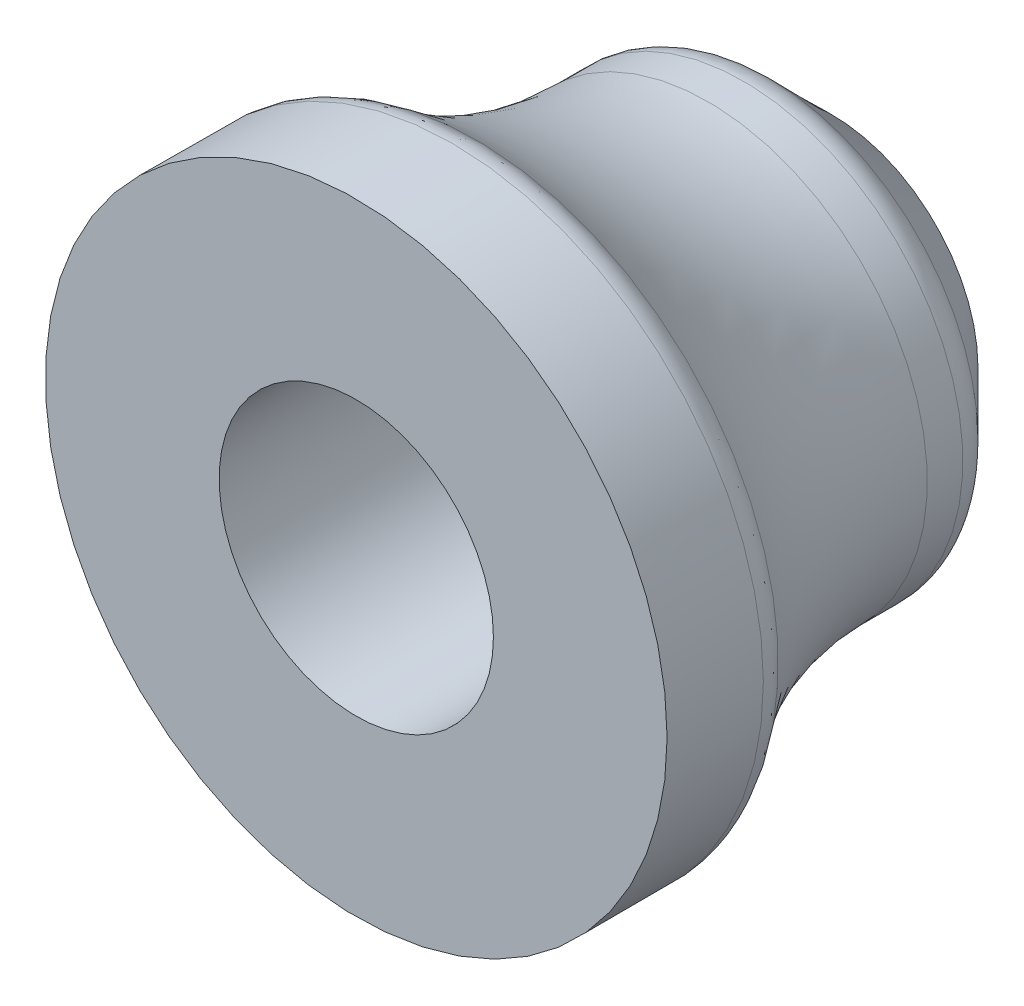
ISO-10303-21;
HEADER;
FILE_DESCRIPTION(('STEP AP214'),'2;1');
FILE_NAME('part.step','',(''),(''),'','','');
FILE_SCHEMA(('AUTOMOTIVE_DESIGN { 1 0 10303 214 1 1 1 1 }'));
ENDSEC;
DATA;
#1=APPLICATION_CONTEXT('core data for automotive mechanical design processes');
#2=APPLICATION_PROTOCOL_DEFINITION('international standard','automotive_design',2000,#1);
#3=PRODUCT_CONTEXT('',#1,'mechanical');
#4=PRODUCT('Part','Part','',(#3));
#5=PRODUCT_RELATED_PRODUCT_CATEGORY('part','',(#4));
#6=PRODUCT_DEFINITION_FORMATION('','',#4);
#7=PRODUCT_DEFINITION_CONTEXT('part definition',#1,'design');
#8=PRODUCT_DEFINITION('design','',#6,#7);
#9=PRODUCT_DEFINITION_SHAPE('','',#8);
#10=(LENGTH_UNIT() NAMED_UNIT(*) SI_UNIT(.MILLI.,.METRE.));
#11=(NAMED_UNIT(*) PLANE_ANGLE_UNIT() SI_UNIT($,.RADIAN.));
#12=(NAMED_UNIT(*) SI_UNIT($,.STERADIAN.) SOLID_ANGLE_UNIT());
#13=UNCERTAINTY_MEASURE_WITH_UNIT(LENGTH_MEASURE(1.E-05),#10,'distance_accuracy_value','');
#14=(GEOMETRIC_REPRESENTATION_CONTEXT(3) GLOBAL_UNCERTAINTY_ASSIGNED_CONTEXT((#13)) GLOBAL_UNIT_ASSIGNED_CONTEXT((#10,
#11,#12)) REPRESENTATION_CONTEXT('',''));
#15=CARTESIAN_POINT('',(0.,0.,0.));
#16=DIRECTION('',(0.,0.,1.));
#17=DIRECTION('',(1.,0.,0.));
#18=AXIS2_PLACEMENT_3D('',#15,#16,#17);
#19=CARTESIAN_POINT('',(0.,0.,0.));
#20=DIRECTION('',(0.,0.,1.));
#21=DIRECTION('',(1.,0.,0.));
#22=AXIS2_PLACEMENT_3D('',#19,#20,#21);
#23=PLANE('',#22);
#24=CARTESIAN_POINT('',(0.,0.,0.));
#25=DIRECTION('',(0.,0.,1.));
#26=DIRECTION('',(1.,0.,0.));
#27=AXIS2_PLACEMENT_3D('',#24,#25,#26);
#28=CIRCLE('',#27,3.99999999999998);
#29=CARTESIAN_POINT('',(2.63100816623241,-3.01293810577287,0.));
#30=VERTEX_POINT('',#29);
#31=CARTESIAN_POINT('',(2.63100816623241,3.01293810577287,0.));
#32=VERTEX_POINT('',#31);
#33=EDGE_CURVE('E252',#30,#32,#28,.F.);
#34=ORIENTED_EDGE('',*,*,#33,.T.);
#35=DIRECTION('',(1.,0.,0.));
#36=VECTOR('',#35,1.);
#37=CARTESIAN_POINT('',(2.63100816623241,3.01293810577287,0.));
#38=LINE('',#37,#36);
#39=CARTESIAN_POINT('',(0.875588873956595,3.01293810577287,0.));
#40=VERTEX_POINT('',#39);
#41=EDGE_CURVE('E54',#40,#32,#38,.T.);
#42=ORIENTED_EDGE('',*,*,#41,.F.);
#43=DIRECTION('',(0.,1.,0.));
#44=VECTOR('',#43,1.);
#45=CARTESIAN_POINT('',(0.875588873956595,3.01293810577287,0.));
#46=LINE('',#45,#44);
#47=CARTESIAN_POINT('',(0.875588873956594,0.877709646137907,0.));
#48=VERTEX_POINT('',#47);
#49=EDGE_CURVE('E155',#48,#40,#46,.T.);
#50=ORIENTED_EDGE('',*,*,#49,.F.);
#51=DIRECTION('',(0.608440006967927,-0.793599872681989,0.));
#52=VECTOR('',#51,1.);
#53=CARTESIAN_POINT('',(0.875588873956594,0.877709646137907,0.));
#54=LINE('',#53,#52);
#55=CARTESIAN_POINT('',(-0.761455767277883,3.01293810577287,0.));
#56=VERTEX_POINT('',#55);
#57=EDGE_CURVE('E158',#56,#48,#54,.T.);
#58=ORIENTED_EDGE('',*,*,#57,.F.);
#59=DIRECTION('',(1.,0.,0.));
#60=VECTOR('',#59,1.);
#61=CARTESIAN_POINT('',(-0.761455767277883,3.01293810577287,0.));
#62=LINE('',#61,#60);
#63=CARTESIAN_POINT('',(-2.5168750595537,3.01293810577287,0.));
#64=VERTEX_POINT('',#63);
#65=EDGE_CURVE('E204',#64,#56,#62,.T.);
#66=ORIENTED_EDGE('',*,*,#65,.F.);
#67=DIRECTION('',(-0.608440006967927,0.793599872681989,0.));
#68=VECTOR('',#67,1.);
#69=CARTESIAN_POINT('',(-2.5168750595537,3.01293810577287,0.));
#70=LINE('',#69,#68);
#71=CARTESIAN_POINT('',(-0.20690482748314,0.,0.));
#72=VERTEX_POINT('',#71);
#73=EDGE_CURVE('E201',#72,#64,#70,.T.);
#74=ORIENTED_EDGE('',*,*,#73,.F.);
#75=DIRECTION('',(0.608440006967927,0.793599872681989,0.));
#76=VECTOR('',#75,1.);
#77=CARTESIAN_POINT('',(-0.20690482748314,0.,0.));
#78=LINE('',#77,#76);
#79=CARTESIAN_POINT('',(-2.5168750595537,-3.01293810577287,0.));
#80=VERTEX_POINT('',#79);
#81=EDGE_CURVE('E198',#80,#72,#78,.T.);
#82=ORIENTED_EDGE('',*,*,#81,.F.);
#83=DIRECTION('',(-1.,0.,0.));
#84=VECTOR('',#83,1.);
#85=CARTESIAN_POINT('',(-2.5168750595537,-3.01293810577287,0.));
#86=LINE('',#85,#84);
#87=CARTESIAN_POINT('',(-0.761455767277883,-3.01293810577287,0.));
#88=VERTEX_POINT('',#87);
#89=EDGE_CURVE('E195',#88,#80,#86,.T.);
#90=ORIENTED_EDGE('',*,*,#89,.F.);
#91=DIRECTION('',(-0.608440006967927,-0.793599872681989,0.));
#92=VECTOR('',#91,1.);
#93=CARTESIAN_POINT('',(-0.761455767277883,-3.01293810577287,0.));
#94=LINE('',#93,#92);
#95=CARTESIAN_POINT('',(0.875588873956594,-0.877709646137907,0.));
#96=VERTEX_POINT('',#95);
#97=EDGE_CURVE('E192',#96,#88,#94,.T.);
#98=ORIENTED_EDGE('',*,*,#97,.F.);
#99=DIRECTION('',(0.,1.,0.));
#100=VECTOR('',#99,1.);
#101=CARTESIAN_POINT('',(0.875588873956594,-0.877709646137907,0.));
#102=LINE('',#101,#100);
#103=CARTESIAN_POINT('',(0.875588873956595,-3.01293810577287,0.));
#104=VERTEX_POINT('',#103);
#105=EDGE_CURVE('E189',#104,#96,#102,.T.);
#106=ORIENTED_EDGE('',*,*,#105,.F.);
#107=DIRECTION('',(-1.,0.,0.));
#108=VECTOR('',#107,1.);
#109=CARTESIAN_POINT('',(0.875588873956595,-3.01293810577287,0.));
#110=LINE('',#109,#108);
#111=EDGE_CURVE('E186',#30,#104,#110,.T.);
#112=ORIENTED_EDGE('',*,*,#111,.F.);
#113=EDGE_LOOP('',(#34,#42,#50,#58,#66,#74,#82,#90,#98,#106,#112));
#114=FACE_BOUND('',#113,.T.);
#115=ADVANCED_FACE('F39',(#114),#23,.F.);
#116=CARTESIAN_POINT('',(0.,0.,13.));
#117=DIRECTION('',(0.,0.,1.));
#118=DIRECTION('',(1.,0.,0.));
#119=AXIS2_PLACEMENT_3D('',#116,#117,#118);
#120=PLANE('',#119);
#121=CARTESIAN_POINT('',(0.,0.,13.));
#122=DIRECTION('',(0.,0.,1.));
#123=DIRECTION('',(1.,0.,0.));
#124=AXIS2_PLACEMENT_3D('',#121,#122,#123);
#125=CIRCLE('',#124,3.75);
#126=CARTESIAN_POINT('',(3.75,0.,13.));
#127=VERTEX_POINT('',#126);
#128=EDGE_CURVE('E231',#127,#127,#125,.T.);
#129=ORIENTED_EDGE('',*,*,#128,.F.);
#130=EDGE_LOOP('',(#129));
#131=FACE_BOUND('',#130,.T.);
#132=CARTESIAN_POINT('',(0.,0.,13.));
#133=DIRECTION('',(0.,0.,1.));
#134=DIRECTION('',(1.,0.,0.));
#135=AXIS2_PLACEMENT_3D('',#132,#133,#134);
#136=CIRCLE('',#135,8.5);
#137=CARTESIAN_POINT('',(8.5,0.,13.));
#138=VERTEX_POINT('',#137);
#139=EDGE_CURVE('E211',#138,#138,#136,.T.);
#140=ORIENTED_EDGE('',*,*,#139,.T.);
#141=EDGE_LOOP('',(#140));
#142=FACE_BOUND('',#141,.T.);
#143=ADVANCED_FACE('F282',(#131,#142),#120,.T.);
#144=CARTESIAN_POINT('',(0.,0.,3.));
#145=DIRECTION('',(0.,0.,1.));
#146=DIRECTION('',(1.,0.,0.));
#147=AXIS2_PLACEMENT_3D('',#144,#145,#146);
#148=CYLINDRICAL_SURFACE('',#147,3.75);
#149=ORIENTED_EDGE('',*,*,#128,.T.);
#150=EDGE_LOOP('',(#149));
#151=FACE_BOUND('',#150,.T.);
#152=CARTESIAN_POINT('',(0.,0.,3.));
#153=DIRECTION('',(0.,0.,1.));
#154=DIRECTION('',(1.,0.,0.));
#155=AXIS2_PLACEMENT_3D('',#152,#153,#154);
#156=CIRCLE('',#155,3.75);
#157=CARTESIAN_POINT('',(3.75,0.,3.));
#158=VERTEX_POINT('',#157);
#159=EDGE_CURVE('E232',#158,#158,#156,.T.);
#160=ORIENTED_EDGE('',*,*,#159,.F.);
#161=EDGE_LOOP('',(#160));
#162=FACE_BOUND('',#161,.T.);
#163=ADVANCED_FACE('F289',(#151,#162),#148,.F.);
#164=CARTESIAN_POINT('',(0.,0.,3.));
#165=DIRECTION('',(0.,0.,1.));
#166=DIRECTION('',(1.,0.,0.));
#167=AXIS2_PLACEMENT_3D('',#164,#165,#166);
#168=PLANE('',#167);
#169=CARTESIAN_POINT('',(0.,0.,3.));
#170=DIRECTION('',(0.,0.,1.));
#171=DIRECTION('',(1.,0.,0.));
#172=AXIS2_PLACEMENT_3D('',#169,#170,#171);
#173=CIRCLE('',#172,3.05);
#174=CARTESIAN_POINT('',(2.68328157299975,1.45,3.));
#175=VERTEX_POINT('',#174);
#176=CARTESIAN_POINT('',(-2.68328157299975,1.45,3.));
#177=VERTEX_POINT('',#176);
#178=EDGE_CURVE('E247',#175,#177,#173,.F.);
#179=ORIENTED_EDGE('',*,*,#178,.T.);
#180=DIRECTION('',(-1.,0.,0.));
#181=VECTOR('',#180,1.);
#182=CARTESIAN_POINT('',(0.,1.45,3.));
#183=LINE('',#182,#181);
#184=EDGE_CURVE('E61',#175,#177,#183,.T.);
#185=ORIENTED_EDGE('',*,*,#184,.F.);
#186=EDGE_LOOP('',(#179,#185));
#187=FACE_BOUND('',#186,.T.);
#188=ORIENTED_EDGE('',*,*,#159,.T.);
#189=EDGE_LOOP('',(#188));
#190=FACE_BOUND('',#189,.T.);
#191=ADVANCED_FACE('F366',(#187,#190),#168,.T.);
#192=CARTESIAN_POINT('',(0.,0.,0.999999999999999));
#193=DIRECTION('',(0.,0.,1.));
#194=DIRECTION('',(1.,0.,0.));
#195=AXIS2_PLACEMENT_3D('',#192,#193,#194);
#196=PLANE('',#195);
#197=DIRECTION('',(1.,0.,0.));
#198=VECTOR('',#197,1.);
#199=CARTESIAN_POINT('',(0.,1.45,0.999999999999999));
#200=LINE('',#199,#198);
#201=CARTESIAN_POINT('',(-2.68328157299975,1.45,0.999999999999999));
#202=VERTEX_POINT('',#201);
#203=CARTESIAN_POINT('',(2.68328157299975,1.45,0.999999999999999));
#204=VERTEX_POINT('',#203);
#205=EDGE_CURVE('E238',#202,#204,#200,.T.);
#206=ORIENTED_EDGE('',*,*,#205,.F.);
#207=CARTESIAN_POINT('',(0.,0.,0.999999999999999));
#208=DIRECTION('',(0.,0.,1.));
#209=DIRECTION('',(1.,0.,0.));
#210=AXIS2_PLACEMENT_3D('',#207,#208,#209);
#211=CIRCLE('',#210,3.05);
#212=EDGE_CURVE('E240',#202,#204,#211,.T.);
#213=ORIENTED_EDGE('',*,*,#212,.T.);
#214=EDGE_LOOP('',(#206,#213));
#215=FACE_BOUND('',#214,.T.);
#216=ADVANCED_FACE('F369',(#215),#196,.T.);
#217=CARTESIAN_POINT('',(0.,0.,0.999999999999999));
#218=DIRECTION('',(0.,0.,1.));
#219=DIRECTION('',(1.,0.,0.));
#220=AXIS2_PLACEMENT_3D('',#217,#218,#219);
#221=CYLINDRICAL_SURFACE('',#220,3.05);
#222=ORIENTED_EDGE('',*,*,#178,.F.);
#223=DIRECTION('',(0.,0.,1.));
#224=VECTOR('',#223,1.);
#225=CARTESIAN_POINT('',(2.68328157299975,1.45,0.999999999999999));
#226=LINE('',#225,#224);
#227=EDGE_CURVE('E244',#204,#175,#226,.T.);
#228=ORIENTED_EDGE('',*,*,#227,.F.);
#229=ORIENTED_EDGE('',*,*,#212,.F.);
#230=DIRECTION('',(0.,0.,1.));
#231=VECTOR('',#230,1.);
#232=CARTESIAN_POINT('',(-2.68328157299975,1.45,0.999999999999999));
#233=LINE('',#232,#231);
#234=EDGE_CURVE('E243',#202,#177,#233,.T.);
#235=ORIENTED_EDGE('',*,*,#234,.T.);
#236=EDGE_LOOP('',(#222,#228,#229,#235));
#237=FACE_BOUND('',#236,.T.);
#238=ADVANCED_FACE('F375',(#237),#221,.F.);
#239=CARTESIAN_POINT('',(0.,1.45,0.999999999999999));
#240=DIRECTION('',(0.,-1.,0.));
#241=DIRECTION('',(0.,0.,-1.));
#242=AXIS2_PLACEMENT_3D('',#239,#240,#241);
#243=PLANE('',#242);
#244=ORIENTED_EDGE('',*,*,#227,.T.);
#245=ORIENTED_EDGE('',*,*,#184,.T.);
#246=ORIENTED_EDGE('',*,*,#234,.F.);
#247=ORIENTED_EDGE('',*,*,#205,.T.);
#248=EDGE_LOOP('',(#244,#245,#246,#247));
#249=FACE_BOUND('',#248,.T.);
#250=ADVANCED_FACE('F303',(#249),#243,.T.);
#251=CARTESIAN_POINT('',(0.,0.,10.));
#252=DIRECTION('',(0.,0.,1.));
#253=DIRECTION('',(1.,0.,0.));
#254=AXIS2_PLACEMENT_3D('',#251,#252,#253);
#255=CYLINDRICAL_SURFACE('',#254,8.5);
#256=CARTESIAN_POINT('',(0.,0.,10.367741744223));
#257=DIRECTION('',(0.,0.,-1.));
#258=DIRECTION('',(-1.,0.,0.));
#259=AXIS2_PLACEMENT_3D('',#256,#257,#258);
#260=CIRCLE('',#259,8.5);
#261=CARTESIAN_POINT('',(-8.5,0.,10.367741744223));
#262=VERTEX_POINT('',#261);
#263=EDGE_CURVE('E47',#262,#262,#260,.F.);
#264=ORIENTED_EDGE('',*,*,#263,.T.);
#265=EDGE_LOOP('',(#264));
#266=FACE_BOUND('',#265,.T.);
#267=ORIENTED_EDGE('',*,*,#139,.F.);
#268=EDGE_LOOP('',(#267));
#269=FACE_BOUND('',#268,.T.);
#270=ADVANCED_FACE('F266',(#266,#269),#255,.T.);
#271=EDGE_CURVE('E251',#32,#30,#28,.F.);
#272=ORIENTED_EDGE('',*,*,#271,.T.);
#273=DIRECTION('',(0.,-1.,0.));
#274=VECTOR('',#273,1.);
#275=CARTESIAN_POINT('',(2.63100816623241,3.01293810577287,0.));
#276=LINE('',#275,#274);
#277=EDGE_CURVE('E184',#32,#30,#276,.T.);
#278=ORIENTED_EDGE('',*,*,#277,.F.);
#279=EDGE_LOOP('',(#272,#278));
#280=FACE_BOUND('',#279,.T.);
#281=ADVANCED_FACE('F285',(#280),#23,.F.);
#282=CARTESIAN_POINT('',(0.,0.,2.00000000000001));
#283=DIRECTION('',(0.,0.,1.));
#284=DIRECTION('',(1.,0.,0.));
#285=AXIS2_PLACEMENT_3D('',#282,#283,#284);
#286=CONICAL_SURFACE('',#285,6.,0.78539816339745);
#287=CARTESIAN_POINT('',(0.,0.,1.70710678118656));
#288=DIRECTION('',(0.,0.,1.));
#289=DIRECTION('',(1.,0.,0.));
#290=AXIS2_PLACEMENT_3D('',#287,#288,#289);
#291=CIRCLE('',#290,5.70710678118655);
#292=CARTESIAN_POINT('',(5.70710678118655,0.,1.70710678118656));
#293=VERTEX_POINT('',#292);
#294=EDGE_CURVE('E261',#293,#293,#291,.F.);
#295=ORIENTED_EDGE('',*,*,#294,.T.);
#296=EDGE_LOOP('',(#295));
#297=FACE_BOUND('',#296,.T.);
#298=ORIENTED_EDGE('',*,*,#33,.F.);
#299=ORIENTED_EDGE('',*,*,#271,.F.);
#300=EDGE_LOOP('',(#298,#299));
#301=FACE_BOUND('',#300,.T.);
#302=ADVANCED_FACE('F294',(#297,#301),#286,.T.);
#303=CARTESIAN_POINT('',(0.,0.,13.));
#304=DIRECTION('',(0.,0.,-1.));
#305=DIRECTION('',(-1.,0.,0.));
#306=AXIS2_PLACEMENT_3D('',#303,#304,#305);
#307=CYLINDRICAL_SURFACE('',#306,6.);
#308=CARTESIAN_POINT('',(0.,0.,2.41421356237311));
#309=DIRECTION('',(0.,0.,-1.));
#310=DIRECTION('',(-1.,0.,0.));
#311=AXIS2_PLACEMENT_3D('',#308,#309,#310);
#312=CIRCLE('',#311,6.);
#313=CARTESIAN_POINT('',(-6.,0.,2.41421356237311));
#314=VERTEX_POINT('',#313);
#315=EDGE_CURVE('E258',#314,#314,#312,.F.);
#316=CARTESIAN_POINT('',(0.,0.,3.38562172233852));
#317=DIRECTION('',(0.,0.,1.));
#318=DIRECTION('',(1.,0.,0.));
#319=AXIS2_PLACEMENT_3D('',#316,#317,#318);
#320=CIRCLE('',#319,6.);
#321=CARTESIAN_POINT('',(-6.,0.,3.38562172233852));
#322=VERTEX_POINT('',#321);
#323=EDGE_CURVE('E255',#322,#322,#320,.F.);
#324=CARTESIAN_POINT('',(-6.,0.,2.41421356237311));
#325=CARTESIAN_POINT('',(-6.,0.,2.42433239737275));
#326=CARTESIAN_POINT('',(-6.,0.,2.43445123237239));
#327=CARTESIAN_POINT('',(-6.,0.,2.45468890237167));
#328=CARTESIAN_POINT('',(-6.,0.,2.46480773737131));
#329=CARTESIAN_POINT('',(-6.,0.,2.48504540737059));
#330=CARTESIAN_POINT('',(-6.,0.,2.49516424237023));
#331=CARTESIAN_POINT('',(-6.,0.,2.51540191236951));
#332=CARTESIAN_POINT('',(-6.,0.,2.52552074736915));
#333=CARTESIAN_POINT('',(-6.,0.,2.54575841736842));
#334=CARTESIAN_POINT('',(-6.,0.,2.55587725236806));
#335=CARTESIAN_POINT('',(-6.,0.,2.57611492236734));
#336=CARTESIAN_POINT('',(-6.,0.,2.58623375736698));
#337=CARTESIAN_POINT('',(-6.,0.,2.60647142736626));
#338=CARTESIAN_POINT('',(-6.,0.,2.6165902623659));
#339=CARTESIAN_POINT('',(-6.,0.,2.63682793236518));
#340=CARTESIAN_POINT('',(-6.,0.,2.64694676736482));
#341=CARTESIAN_POINT('',(-6.,0.,2.6671844373641));
#342=CARTESIAN_POINT('',(-6.,0.,2.67730327236374));
#343=CARTESIAN_POINT('',(-6.,0.,2.69754094236302));
#344=CARTESIAN_POINT('',(-6.,0.,2.70765977736266));
#345=CARTESIAN_POINT('',(-6.,0.,2.72789744736194));
#346=CARTESIAN_POINT('',(-6.,0.,2.73801628236158));
#347=CARTESIAN_POINT('',(-6.,0.,2.75825395236086));
#348=CARTESIAN_POINT('',(-6.,0.,2.7683727873605));
#349=CARTESIAN_POINT('',(-6.,0.,2.78861045735978));
#350=CARTESIAN_POINT('',(-6.,0.,2.79872929235942));
#351=CARTESIAN_POINT('',(-6.,0.,2.8189669623587));
#352=CARTESIAN_POINT('',(-6.,0.,2.82908579735834));
#353=CARTESIAN_POINT('',(-6.,0.,2.84932346735762));
#354=CARTESIAN_POINT('',(-6.,0.,2.85944230235726));
#355=CARTESIAN_POINT('',(-6.,0.,2.87967997235653));
#356=CARTESIAN_POINT('',(-6.,0.,2.88979880735617));
#357=CARTESIAN_POINT('',(-6.,0.,2.91003647735545));
#358=CARTESIAN_POINT('',(-6.,0.,2.92015531235509));
#359=CARTESIAN_POINT('',(-6.,0.,2.94039298235437));
#360=CARTESIAN_POINT('',(-6.,0.,2.95051181735401));
#361=CARTESIAN_POINT('',(-6.,0.,2.97074948735329));
#362=CARTESIAN_POINT('',(-6.,0.,2.98086832235293));
#363=CARTESIAN_POINT('',(-6.,0.,3.00110599235221));
#364=CARTESIAN_POINT('',(-6.,0.,3.01122482735185));
#365=CARTESIAN_POINT('',(-6.,0.,3.03146249735113));
#366=CARTESIAN_POINT('',(-6.,0.,3.04158133235077));
#367=CARTESIAN_POINT('',(-6.,0.,3.06181900235005));
#368=CARTESIAN_POINT('',(-6.,0.,3.07193783734969));
#369=CARTESIAN_POINT('',(-6.,0.,3.09217550734897));
#370=CARTESIAN_POINT('',(-6.,0.,3.10229434234861));
#371=CARTESIAN_POINT('',(-6.,0.,3.12253201234789));
#372=CARTESIAN_POINT('',(-6.,0.,3.13265084734753));
#373=CARTESIAN_POINT('',(-6.,0.,3.15288851734681));
#374=CARTESIAN_POINT('',(-6.,0.,3.16300735234645));
#375=CARTESIAN_POINT('',(-6.,0.,3.18324502234573));
#376=CARTESIAN_POINT('',(-6.,0.,3.19336385734537));
#377=CARTESIAN_POINT('',(-6.,0.,3.21360152734465));
#378=CARTESIAN_POINT('',(-6.,0.,3.22372036234429));
#379=CARTESIAN_POINT('',(-6.,0.,3.24395803234356));
#380=CARTESIAN_POINT('',(-6.,0.,3.2540768673432));
#381=CARTESIAN_POINT('',(-6.,0.,3.27431453734248));
#382=CARTESIAN_POINT('',(-6.,0.,3.28443337234212));
#383=CARTESIAN_POINT('',(-6.,0.,3.3046710423414));
#384=CARTESIAN_POINT('',(-6.,0.,3.31478987734104));
#385=CARTESIAN_POINT('',(-6.,0.,3.33502754734032));
#386=CARTESIAN_POINT('',(-6.,0.,3.34514638233996));
#387=CARTESIAN_POINT('',(-6.,0.,3.36538405233924));
#388=CARTESIAN_POINT('',(-6.,0.,3.37550288733888));
#389=CARTESIAN_POINT('',(-6.,0.,3.38562172233852));
#390=B_SPLINE_CURVE_WITH_KNOTS('',3,(#324,#325,#326,#327,#328,#329,#330,#331,#332,#333,#334,
#335,#336,#337,#338,#339,#340,#341,#342,#343,#344,#345,#346,#347,#348,#349,#350,#351,#352,#353,
#354,#355,#356,#357,#358,#359,#360,#361,#362,#363,#364,#365,#366,#367,#368,#369,#370,#371,#372,
#373,#374,#375,#376,#377,#378,#379,#380,#381,#382,#383,#384,#385,#386,#387,#388,#389),
.UNSPECIFIED.,.F.,.F.,(4,2,2,2,2,2,2,2,2,2,2,2,2,2,2,2,2,2,2,2,2,2,2,2,2,2,2,2,2,2,2,2,4),(0.,
0.0303565049989199,0.0607130099978381,0.091069514996758,0.121426019995676,0.151782524994596,
0.182139029993514,0.212495534992434,0.242852039991352,0.273208544990272,0.303565049989192,
0.33392155498811,0.36427805998703,0.394634564985948,0.424991069984868,0.455347574983786,
0.485704079982706,0.516060584981626,0.546417089980544,0.576773594979464,0.607130099978382,
0.637486604977302,0.66784310997622,0.69819961497514,0.72855611997406,0.758912624972978,
0.789269129971898,0.819625634970816,0.849982139969736,0.880338644968654,0.910695149967574,
0.941051654966493,0.971408159965412),.UNSPECIFIED.);
#391=EDGE_CURVE('BSEAM300',#314,#322,#390,.T.);
#392=ORIENTED_EDGE('',*,*,#315,.T.);
#393=ORIENTED_EDGE('',*,*,#323,.T.);
#394=ORIENTED_EDGE('',*,*,#391,.T.);
#395=ORIENTED_EDGE('',*,*,#391,.F.);
#396=EDGE_LOOP('',(#392,#394,#393,#395));
#397=FACE_BOUND('',#396,.T.);
#398=ADVANCED_FACE('F300',(#397),#307,.T.);
#399=CARTESIAN_POINT('',(0.,0.,3.38562172233852));
#400=DIRECTION('',(0.,0.,1.));
#401=DIRECTION('',(1.,0.,0.));
#402=AXIS2_PLACEMENT_3D('',#399,#400,#401);
#403=TOROIDAL_SURFACE('',#402,16.,10.);
#404=CARTESIAN_POINT('',(0.,0.,9.73300356041531));
#405=DIRECTION('',(0.,0.,-1.));
#406=DIRECTION('',(-1.,0.,0.));
#407=AXIS2_PLACEMENT_3D('',#404,#405,#406);
#408=CIRCLE('',#407,8.27272727272727);
#409=CARTESIAN_POINT('',(-8.27272727272727,0.,9.73300356041531));
#410=VERTEX_POINT('',#409);
#411=EDGE_CURVE('E11',#410,#410,#408,.T.);
#412=ORIENTED_EDGE('',*,*,#411,.T.);
#413=EDGE_LOOP('',(#412));
#414=FACE_BOUND('',#413,.T.);
#415=ORIENTED_EDGE('',*,*,#323,.F.);
#416=EDGE_LOOP('',(#415));
#417=FACE_BOUND('',#416,.T.);
#418=ADVANCED_FACE('F278',(#414,#417),#403,.F.);
#419=CARTESIAN_POINT('',(0.,0.,2.41421356237311));
#420=DIRECTION('',(0.,0.,-1.));
#421=DIRECTION('',(-1.,0.,0.));
#422=AXIS2_PLACEMENT_3D('',#419,#420,#421);
#423=TOROIDAL_SURFACE('',#422,5.,1.);
#424=ORIENTED_EDGE('',*,*,#294,.F.);
#425=EDGE_LOOP('',(#424));
#426=FACE_BOUND('',#425,.T.);
#427=ORIENTED_EDGE('',*,*,#315,.F.);
#428=EDGE_LOOP('',(#427));
#429=FACE_BOUND('',#428,.T.);
#430=ADVANCED_FACE('F270',(#426,#429),#423,.T.);
#431=CARTESIAN_POINT('',(0.,0.,10.367741744223));
#432=DIRECTION('',(0.,0.,-1.));
#433=DIRECTION('',(-1.,0.,0.));
#434=AXIS2_PLACEMENT_3D('',#431,#432,#433);
#435=TOROIDAL_SURFACE('',#434,7.5,1.);
#436=ORIENTED_EDGE('',*,*,#411,.F.);
#437=EDGE_LOOP('',(#436));
#438=FACE_BOUND('',#437,.T.);
#439=ORIENTED_EDGE('',*,*,#263,.F.);
#440=EDGE_LOOP('',(#439));
#441=FACE_BOUND('',#440,.T.);
#442=ADVANCED_FACE('F41',(#438,#441),#435,.T.);
#443=CARTESIAN_POINT('',(2.63100816623241,3.01293810577287,0.2));
#444=DIRECTION('',(0.,1.,0.));
#445=DIRECTION('',(0.,0.,1.));
#446=AXIS2_PLACEMENT_3D('',#443,#444,#445);
#447=PLANE('',#446);
#448=ORIENTED_EDGE('',*,*,#41,.T.);
#449=DIRECTION('',(0.,0.,-1.));
#450=VECTOR('',#449,1.);
#451=CARTESIAN_POINT('',(2.63100816623241,3.01293810577287,0.2));
#452=LINE('',#451,#450);
#453=CARTESIAN_POINT('',(2.63100816623241,3.01293810577287,0.2));
#454=VERTEX_POINT('',#453);
#455=EDGE_CURVE('E132',#454,#32,#452,.T.);
#456=ORIENTED_EDGE('',*,*,#455,.F.);
#457=DIRECTION('',(1.,0.,0.));
#458=VECTOR('',#457,1.);
#459=CARTESIAN_POINT('',(2.63100816623241,3.01293810577287,0.2));
#460=LINE('',#459,#458);
#461=CARTESIAN_POINT('',(0.875588873956595,3.01293810577287,0.2));
#462=VERTEX_POINT('',#461);
#463=EDGE_CURVE('E136',#462,#454,#460,.T.);
#464=ORIENTED_EDGE('',*,*,#463,.F.);
#465=DIRECTION('',(0.,0.,-1.));
#466=VECTOR('',#465,1.);
#467=CARTESIAN_POINT('',(0.875588873956595,3.01293810577287,0.2));
#468=LINE('',#467,#466);
#469=EDGE_CURVE('E209',#462,#40,#468,.T.);
#470=ORIENTED_EDGE('',*,*,#469,.T.);
#471=EDGE_LOOP('',(#448,#456,#464,#470));
#472=FACE_BOUND('',#471,.T.);
#473=ADVANCED_FACE('F134',(#472),#447,.F.);
#474=CARTESIAN_POINT('',(0.875588873956595,3.01293810577287,0.2));
#475=DIRECTION('',(-1.,0.,0.));
#476=DIRECTION('',(0.,-1.,0.));
#477=AXIS2_PLACEMENT_3D('',#474,#475,#476);
#478=PLANE('',#477);
#479=ORIENTED_EDGE('',*,*,#49,.T.);
#480=ORIENTED_EDGE('',*,*,#469,.F.);
#481=DIRECTION('',(0.,1.,0.));
#482=VECTOR('',#481,1.);
#483=CARTESIAN_POINT('',(0.875588873956595,3.01293810577287,0.2));
#484=LINE('',#483,#482);
#485=CARTESIAN_POINT('',(0.875588873956594,0.877709646137907,0.2));
#486=VERTEX_POINT('',#485);
#487=EDGE_CURVE('E142',#486,#462,#484,.T.);
#488=ORIENTED_EDGE('',*,*,#487,.F.);
#489=DIRECTION('',(0.,0.,-1.));
#490=VECTOR('',#489,1.);
#491=CARTESIAN_POINT('',(0.875588873956594,0.877709646137907,0.2));
#492=LINE('',#491,#490);
#493=EDGE_CURVE('E212',#486,#48,#492,.T.);
#494=ORIENTED_EDGE('',*,*,#493,.T.);
#495=EDGE_LOOP('',(#479,#480,#488,#494));
#496=FACE_BOUND('',#495,.T.);
#497=ADVANCED_FACE('F276',(#496),#478,.F.);
#498=CARTESIAN_POINT('',(0.875588873956594,0.877709646137907,0.2));
#499=DIRECTION('',(0.793599872681989,0.608440006967927,0.));
#500=DIRECTION('',(-0.608440006967927,0.793599872681989,0.));
#501=AXIS2_PLACEMENT_3D('',#498,#499,#500);
#502=PLANE('',#501);
#503=ORIENTED_EDGE('',*,*,#57,.T.);
#504=ORIENTED_EDGE('',*,*,#493,.F.);
#505=DIRECTION('',(0.608440006967927,-0.793599872681989,0.));
#506=VECTOR('',#505,1.);
#507=CARTESIAN_POINT('',(0.875588873956594,0.877709646137907,0.2));
#508=LINE('',#507,#506);
#509=CARTESIAN_POINT('',(-0.761455767277883,3.01293810577287,0.2));
#510=VERTEX_POINT('',#509);
#511=EDGE_CURVE('E180',#510,#486,#508,.T.);
#512=ORIENTED_EDGE('',*,*,#511,.F.);
#513=DIRECTION('',(0.,0.,-1.));
#514=VECTOR('',#513,1.);
#515=CARTESIAN_POINT('',(-0.761455767277883,3.01293810577287,0.2));
#516=LINE('',#515,#514);
#517=EDGE_CURVE('E214',#510,#56,#516,.T.);
#518=ORIENTED_EDGE('',*,*,#517,.T.);
#519=EDGE_LOOP('',(#503,#504,#512,#518));
#520=FACE_BOUND('',#519,.T.);
#521=ADVANCED_FACE('F341',(#520),#502,.F.);
#522=CARTESIAN_POINT('',(-0.761455767277883,3.01293810577287,0.2));
#523=DIRECTION('',(0.,1.,0.));
#524=DIRECTION('',(-1.,0.,0.));
#525=AXIS2_PLACEMENT_3D('',#522,#523,#524);
#526=PLANE('',#525);
#527=ORIENTED_EDGE('',*,*,#65,.T.);
#528=ORIENTED_EDGE('',*,*,#517,.F.);
#529=DIRECTION('',(1.,0.,0.));
#530=VECTOR('',#529,1.);
#531=CARTESIAN_POINT('',(-0.761455767277883,3.01293810577287,0.2));
#532=LINE('',#531,#530);
#533=CARTESIAN_POINT('',(-2.5168750595537,3.01293810577287,0.2));
#534=VERTEX_POINT('',#533);
#535=EDGE_CURVE('E177',#534,#510,#532,.T.);
#536=ORIENTED_EDGE('',*,*,#535,.F.);
#537=DIRECTION('',(0.,0.,-1.));
#538=VECTOR('',#537,1.);
#539=CARTESIAN_POINT('',(-2.5168750595537,3.01293810577287,0.2));
#540=LINE('',#539,#538);
#541=EDGE_CURVE('E216',#534,#64,#540,.T.);
#542=ORIENTED_EDGE('',*,*,#541,.T.);
#543=EDGE_LOOP('',(#527,#528,#536,#542));
#544=FACE_BOUND('',#543,.T.);
#545=ADVANCED_FACE('F336',(#544),#526,.F.);
#546=CARTESIAN_POINT('',(-2.5168750595537,3.01293810577287,0.2));
#547=DIRECTION('',(-0.793599872681989,-0.608440006967927,0.));
#548=DIRECTION('',(0.608440006967927,-0.793599872681989,0.));
#549=AXIS2_PLACEMENT_3D('',#546,#547,#548);
#550=PLANE('',#549);
#551=ORIENTED_EDGE('',*,*,#73,.T.);
#552=ORIENTED_EDGE('',*,*,#541,.F.);
#553=DIRECTION('',(-0.608440006967927,0.793599872681989,0.));
#554=VECTOR('',#553,1.);
#555=CARTESIAN_POINT('',(-2.5168750595537,3.01293810577287,0.2));
#556=LINE('',#555,#554);
#557=CARTESIAN_POINT('',(-0.20690482748314,0.,0.2));
#558=VERTEX_POINT('',#557);
#559=EDGE_CURVE('E174',#558,#534,#556,.T.);
#560=ORIENTED_EDGE('',*,*,#559,.F.);
#561=DIRECTION('',(0.,0.,-1.));
#562=VECTOR('',#561,1.);
#563=CARTESIAN_POINT('',(-0.20690482748314,0.,0.2));
#564=LINE('',#563,#562);
#565=EDGE_CURVE('E218',#558,#72,#564,.T.);
#566=ORIENTED_EDGE('',*,*,#565,.T.);
#567=EDGE_LOOP('',(#551,#552,#560,#566));
#568=FACE_BOUND('',#567,.T.);
#569=ADVANCED_FACE('F332',(#568),#550,.F.);
#570=CARTESIAN_POINT('',(-0.20690482748314,0.,0.2));
#571=DIRECTION('',(-0.793599872681989,0.608440006967927,0.));
#572=DIRECTION('',(-0.608440006967927,-0.793599872681989,0.));
#573=AXIS2_PLACEMENT_3D('',#570,#571,#572);
#574=PLANE('',#573);
#575=ORIENTED_EDGE('',*,*,#81,.T.);
#576=ORIENTED_EDGE('',*,*,#565,.F.);
#577=DIRECTION('',(0.608440006967927,0.793599872681989,0.));
#578=VECTOR('',#577,1.);
#579=CARTESIAN_POINT('',(-0.20690482748314,0.,0.2));
#580=LINE('',#579,#578);
#581=CARTESIAN_POINT('',(-2.5168750595537,-3.01293810577287,0.2));
#582=VERTEX_POINT('',#581);
#583=EDGE_CURVE('E171',#582,#558,#580,.T.);
#584=ORIENTED_EDGE('',*,*,#583,.F.);
#585=DIRECTION('',(0.,0.,-1.));
#586=VECTOR('',#585,1.);
#587=CARTESIAN_POINT('',(-2.5168750595537,-3.01293810577287,0.2));
#588=LINE('',#587,#586);
#589=EDGE_CURVE('E220',#582,#80,#588,.T.);
#590=ORIENTED_EDGE('',*,*,#589,.T.);
#591=EDGE_LOOP('',(#575,#576,#584,#590));
#592=FACE_BOUND('',#591,.T.);
#593=ADVANCED_FACE('F328',(#592),#574,.F.);
#594=CARTESIAN_POINT('',(-2.5168750595537,-3.01293810577287,0.2));
#595=DIRECTION('',(0.,-1.,0.));
#596=DIRECTION('',(0.,0.,-1.));
#597=AXIS2_PLACEMENT_3D('',#594,#595,#596);
#598=PLANE('',#597);
#599=ORIENTED_EDGE('',*,*,#89,.T.);
#600=ORIENTED_EDGE('',*,*,#589,.F.);
#601=DIRECTION('',(-1.,0.,0.));
#602=VECTOR('',#601,1.);
#603=CARTESIAN_POINT('',(-2.5168750595537,-3.01293810577287,0.2));
#604=LINE('',#603,#602);
#605=CARTESIAN_POINT('',(-0.761455767277883,-3.01293810577287,0.2));
#606=VERTEX_POINT('',#605);
#607=EDGE_CURVE('E168',#606,#582,#604,.T.);
#608=ORIENTED_EDGE('',*,*,#607,.F.);
#609=DIRECTION('',(0.,0.,-1.));
#610=VECTOR('',#609,1.);
#611=CARTESIAN_POINT('',(-0.761455767277883,-3.01293810577287,0.2));
#612=LINE('',#611,#610);
#613=EDGE_CURVE('E222',#606,#88,#612,.T.);
#614=ORIENTED_EDGE('',*,*,#613,.T.);
#615=EDGE_LOOP('',(#599,#600,#608,#614));
#616=FACE_BOUND('',#615,.T.);
#617=ADVANCED_FACE('F324',(#616),#598,.F.);
#618=CARTESIAN_POINT('',(-0.761455767277883,-3.01293810577287,0.2));
#619=DIRECTION('',(0.793599872681989,-0.608440006967927,0.));
#620=DIRECTION('',(0.608440006967927,0.793599872681989,0.));
#621=AXIS2_PLACEMENT_3D('',#618,#619,#620);
#622=PLANE('',#621);
#623=ORIENTED_EDGE('',*,*,#97,.T.);
#624=ORIENTED_EDGE('',*,*,#613,.F.);
#625=DIRECTION('',(-0.608440006967927,-0.793599872681989,0.));
#626=VECTOR('',#625,1.);
#627=CARTESIAN_POINT('',(-0.761455767277883,-3.01293810577287,0.2));
#628=LINE('',#627,#626);
#629=CARTESIAN_POINT('',(0.875588873956594,-0.877709646137907,0.2));
#630=VERTEX_POINT('',#629);
#631=EDGE_CURVE('E165',#630,#606,#628,.T.);
#632=ORIENTED_EDGE('',*,*,#631,.F.);
#633=DIRECTION('',(0.,0.,-1.));
#634=VECTOR('',#633,1.);
#635=CARTESIAN_POINT('',(0.875588873956594,-0.877709646137907,0.2));
#636=LINE('',#635,#634);
#637=EDGE_CURVE('E224',#630,#96,#636,.T.);
#638=ORIENTED_EDGE('',*,*,#637,.T.);
#639=EDGE_LOOP('',(#623,#624,#632,#638));
#640=FACE_BOUND('',#639,.T.);
#641=ADVANCED_FACE('F320',(#640),#622,.F.);
#642=CARTESIAN_POINT('',(0.875588873956594,-0.877709646137907,0.2));
#643=DIRECTION('',(-1.,0.,0.));
#644=DIRECTION('',(0.,-1.,0.));
#645=AXIS2_PLACEMENT_3D('',#642,#643,#644);
#646=PLANE('',#645);
#647=ORIENTED_EDGE('',*,*,#105,.T.);
#648=ORIENTED_EDGE('',*,*,#637,.F.);
#649=DIRECTION('',(0.,1.,0.));
#650=VECTOR('',#649,1.);
#651=CARTESIAN_POINT('',(0.875588873956594,-0.877709646137907,0.2));
#652=LINE('',#651,#650);
#653=CARTESIAN_POINT('',(0.875588873956595,-3.01293810577287,0.2));
#654=VERTEX_POINT('',#653);
#655=EDGE_CURVE('E162',#654,#630,#652,.T.);
#656=ORIENTED_EDGE('',*,*,#655,.F.);
#657=DIRECTION('',(0.,0.,-1.));
#658=VECTOR('',#657,1.);
#659=CARTESIAN_POINT('',(0.875588873956595,-3.01293810577287,0.2));
#660=LINE('',#659,#658);
#661=EDGE_CURVE('E226',#654,#104,#660,.T.);
#662=ORIENTED_EDGE('',*,*,#661,.T.);
#663=EDGE_LOOP('',(#647,#648,#656,#662));
#664=FACE_BOUND('',#663,.T.);
#665=ADVANCED_FACE('F318',(#664),#646,.F.);
#666=CARTESIAN_POINT('',(0.875588873956595,-3.01293810577287,0.2));
#667=DIRECTION('',(0.,-1.,0.));
#668=DIRECTION('',(0.,0.,-1.));
#669=AXIS2_PLACEMENT_3D('',#666,#667,#668);
#670=PLANE('',#669);
#671=ORIENTED_EDGE('',*,*,#111,.T.);
#672=ORIENTED_EDGE('',*,*,#661,.F.);
#673=DIRECTION('',(-1.,0.,0.));
#674=VECTOR('',#673,1.);
#675=CARTESIAN_POINT('',(0.875588873956595,-3.01293810577287,0.2));
#676=LINE('',#675,#674);
#677=CARTESIAN_POINT('',(2.63100816623241,-3.01293810577287,0.2));
#678=VERTEX_POINT('',#677);
#679=EDGE_CURVE('E150',#678,#654,#676,.T.);
#680=ORIENTED_EDGE('',*,*,#679,.F.);
#681=DIRECTION('',(0.,0.,-1.));
#682=VECTOR('',#681,1.);
#683=CARTESIAN_POINT('',(2.63100816623241,-3.01293810577287,0.2));
#684=LINE('',#683,#682);
#685=EDGE_CURVE('E141',#678,#30,#684,.T.);
#686=ORIENTED_EDGE('',*,*,#685,.T.);
#687=EDGE_LOOP('',(#671,#672,#680,#686));
#688=FACE_BOUND('',#687,.T.);
#689=ADVANCED_FACE('F314',(#688),#670,.F.);
#690=CARTESIAN_POINT('',(2.63100816623241,3.01293810577287,0.2));
#691=DIRECTION('',(1.,0.,0.));
#692=DIRECTION('',(0.,1.,0.));
#693=AXIS2_PLACEMENT_3D('',#690,#691,#692);
#694=PLANE('',#693);
#695=ORIENTED_EDGE('',*,*,#277,.T.);
#696=ORIENTED_EDGE('',*,*,#685,.F.);
#697=DIRECTION('',(0.,-1.,0.));
#698=VECTOR('',#697,1.);
#699=CARTESIAN_POINT('',(2.63100816623241,3.01293810577287,0.2));
#700=LINE('',#699,#698);
#701=EDGE_CURVE('E145',#454,#678,#700,.T.);
#702=ORIENTED_EDGE('',*,*,#701,.F.);
#703=ORIENTED_EDGE('',*,*,#455,.T.);
#704=EDGE_LOOP('',(#695,#696,#702,#703));
#705=FACE_BOUND('',#704,.T.);
#706=ADVANCED_FACE('F146',(#705),#694,.F.);
#707=CARTESIAN_POINT('',(0.,0.,0.2));
#708=DIRECTION('',(0.,0.,1.));
#709=DIRECTION('',(1.,0.,0.));
#710=AXIS2_PLACEMENT_3D('',#707,#708,#709);
#711=PLANE('',#710);
#712=ORIENTED_EDGE('',*,*,#463,.T.);
#713=ORIENTED_EDGE('',*,*,#701,.T.);
#714=ORIENTED_EDGE('',*,*,#679,.T.);
#715=ORIENTED_EDGE('',*,*,#655,.T.);
#716=ORIENTED_EDGE('',*,*,#631,.T.);
#717=ORIENTED_EDGE('',*,*,#607,.T.);
#718=ORIENTED_EDGE('',*,*,#583,.T.);
#719=ORIENTED_EDGE('',*,*,#559,.T.);
#720=ORIENTED_EDGE('',*,*,#535,.T.);
#721=ORIENTED_EDGE('',*,*,#511,.T.);
#722=ORIENTED_EDGE('',*,*,#487,.T.);
#723=EDGE_LOOP('',(#712,#713,#714,#715,#716,#717,#718,#719,#720,#721,#722));
#724=FACE_BOUND('',#723,.T.);
#725=ADVANCED_FACE('F152',(#724),#711,.F.);
#726=CLOSED_SHELL('',(#115,#143,#163,#191,#216,#238,#250,#270,#281,#302,#398,#418,#430,#442,
#473,#497,#521,#545,#569,#593,#617,#641,#665,#689,#706,#725));
#727=MANIFOLD_SOLID_BREP('B2',#726);
#728=ADVANCED_BREP_SHAPE_REPRESENTATION('',(#18,#727),#14);
#729=SHAPE_DEFINITION_REPRESENTATION(#9,#728);
ENDSEC;
END-ISO-10303-21;
